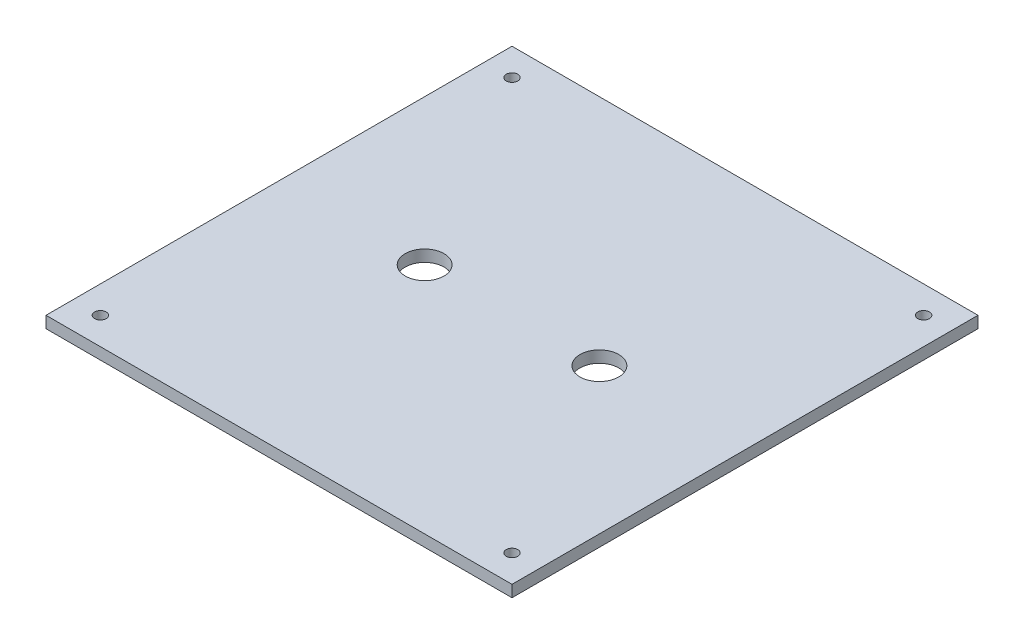
ISO-10303-21;
HEADER;
FILE_DESCRIPTION(('STEP AP214'),'2;1');
FILE_NAME('part.step','',(''),(''),'','','');
FILE_SCHEMA(('AUTOMOTIVE_DESIGN { 1 0 10303 214 1 1 1 1 }'));
ENDSEC;
DATA;
#1=APPLICATION_CONTEXT('core data for automotive mechanical design processes');
#2=APPLICATION_PROTOCOL_DEFINITION('international standard','automotive_design',2000,#1);
#3=PRODUCT_CONTEXT('',#1,'mechanical');
#4=PRODUCT('Part','Part','',(#3));
#5=PRODUCT_RELATED_PRODUCT_CATEGORY('part','',(#4));
#6=PRODUCT_DEFINITION_FORMATION('','',#4);
#7=PRODUCT_DEFINITION_CONTEXT('part definition',#1,'design');
#8=PRODUCT_DEFINITION('design','',#6,#7);
#9=PRODUCT_DEFINITION_SHAPE('','',#8);
#10=(LENGTH_UNIT() NAMED_UNIT(*) SI_UNIT(.MILLI.,.METRE.));
#11=(NAMED_UNIT(*) PLANE_ANGLE_UNIT() SI_UNIT($,.RADIAN.));
#12=(NAMED_UNIT(*) SI_UNIT($,.STERADIAN.) SOLID_ANGLE_UNIT());
#13=UNCERTAINTY_MEASURE_WITH_UNIT(LENGTH_MEASURE(1.E-05),#10,'distance_accuracy_value','');
#14=(GEOMETRIC_REPRESENTATION_CONTEXT(3) GLOBAL_UNCERTAINTY_ASSIGNED_CONTEXT((#13)) GLOBAL_UNIT_ASSIGNED_CONTEXT((#10,
#11,#12)) REPRESENTATION_CONTEXT('',''));
#15=CARTESIAN_POINT('',(0.,0.,0.));
#16=DIRECTION('',(0.,0.,1.));
#17=DIRECTION('',(1.,0.,0.));
#18=AXIS2_PLACEMENT_3D('',#15,#16,#17);
#19=CARTESIAN_POINT('',(60.,3.,60.));
#20=DIRECTION('',(-1.,0.,0.));
#21=DIRECTION('',(0.,0.,1.));
#22=AXIS2_PLACEMENT_3D('',#19,#20,#21);
#23=PLANE('',#22);
#24=DIRECTION('',(0.,0.,-1.));
#25=VECTOR('',#24,1.);
#26=CARTESIAN_POINT('',(60.,0.,60.));
#27=LINE('',#26,#25);
#28=CARTESIAN_POINT('',(60.,0.,60.));
#29=VERTEX_POINT('',#28);
#30=CARTESIAN_POINT('',(60.,0.,-60.));
#31=VERTEX_POINT('',#30);
#32=EDGE_CURVE('E96',#29,#31,#27,.T.);
#33=ORIENTED_EDGE('',*,*,#32,.T.);
#34=DIRECTION('',(0.,-1.,0.));
#35=VECTOR('',#34,1.);
#36=CARTESIAN_POINT('',(60.,3.,-60.));
#37=LINE('',#36,#35);
#38=CARTESIAN_POINT('',(60.,3.,-60.));
#39=VERTEX_POINT('',#38);
#40=EDGE_CURVE('E11',#39,#31,#37,.T.);
#41=ORIENTED_EDGE('',*,*,#40,.F.);
#42=DIRECTION('',(0.,0.,-1.));
#43=VECTOR('',#42,1.);
#44=CARTESIAN_POINT('',(60.,3.,60.));
#45=LINE('',#44,#43);
#46=CARTESIAN_POINT('',(60.,3.,60.));
#47=VERTEX_POINT('',#46);
#48=EDGE_CURVE('E84',#47,#39,#45,.T.);
#49=ORIENTED_EDGE('',*,*,#48,.F.);
#50=DIRECTION('',(0.,-1.,0.));
#51=VECTOR('',#50,1.);
#52=CARTESIAN_POINT('',(60.,3.,60.));
#53=LINE('',#52,#51);
#54=EDGE_CURVE('E92',#47,#29,#53,.T.);
#55=ORIENTED_EDGE('',*,*,#54,.T.);
#56=EDGE_LOOP('',(#33,#41,#49,#55));
#57=FACE_BOUND('',#56,.T.);
#58=ADVANCED_FACE('F33',(#57),#23,.F.);
#59=CARTESIAN_POINT('',(-60.,3.,-60.));
#60=DIRECTION('',(0.,0.,1.));
#61=DIRECTION('',(1.,0.,0.));
#62=AXIS2_PLACEMENT_3D('',#59,#60,#61);
#63=PLANE('',#62);
#64=DIRECTION('',(-1.,0.,0.));
#65=VECTOR('',#64,1.);
#66=CARTESIAN_POINT('',(-60.,0.,-60.));
#67=LINE('',#66,#65);
#68=CARTESIAN_POINT('',(-60.,0.,-60.));
#69=VERTEX_POINT('',#68);
#70=EDGE_CURVE('E88',#31,#69,#67,.T.);
#71=ORIENTED_EDGE('',*,*,#70,.T.);
#72=DIRECTION('',(0.,-1.,0.));
#73=VECTOR('',#72,1.);
#74=CARTESIAN_POINT('',(-60.,3.,-60.));
#75=LINE('',#74,#73);
#76=CARTESIAN_POINT('',(-60.,3.,-60.));
#77=VERTEX_POINT('',#76);
#78=EDGE_CURVE('E41',#77,#69,#75,.T.);
#79=ORIENTED_EDGE('',*,*,#78,.F.);
#80=DIRECTION('',(-1.,0.,0.));
#81=VECTOR('',#80,1.);
#82=CARTESIAN_POINT('',(-60.,3.,-60.));
#83=LINE('',#82,#81);
#84=EDGE_CURVE('E79',#39,#77,#83,.T.);
#85=ORIENTED_EDGE('',*,*,#84,.F.);
#86=ORIENTED_EDGE('',*,*,#40,.T.);
#87=EDGE_LOOP('',(#71,#79,#85,#86));
#88=FACE_BOUND('',#87,.T.);
#89=ADVANCED_FACE('F87',(#88),#63,.F.);
#90=CARTESIAN_POINT('',(-60.,3.,60.));
#91=DIRECTION('',(1.,0.,0.));
#92=DIRECTION('',(0.,0.,-1.));
#93=AXIS2_PLACEMENT_3D('',#90,#91,#92);
#94=PLANE('',#93);
#95=DIRECTION('',(0.,0.,1.));
#96=VECTOR('',#95,1.);
#97=CARTESIAN_POINT('',(-60.,0.,60.));
#98=LINE('',#97,#96);
#99=CARTESIAN_POINT('',(-60.,0.,60.));
#100=VERTEX_POINT('',#99);
#101=EDGE_CURVE('E66',#69,#100,#98,.T.);
#102=ORIENTED_EDGE('',*,*,#101,.T.);
#103=DIRECTION('',(0.,-1.,0.));
#104=VECTOR('',#103,1.);
#105=CARTESIAN_POINT('',(-60.,3.,60.));
#106=LINE('',#105,#104);
#107=CARTESIAN_POINT('',(-60.,3.,60.));
#108=VERTEX_POINT('',#107);
#109=EDGE_CURVE('E89',#108,#100,#106,.T.);
#110=ORIENTED_EDGE('',*,*,#109,.F.);
#111=DIRECTION('',(0.,0.,1.));
#112=VECTOR('',#111,1.);
#113=CARTESIAN_POINT('',(-60.,3.,60.));
#114=LINE('',#113,#112);
#115=EDGE_CURVE('E82',#77,#108,#114,.T.);
#116=ORIENTED_EDGE('',*,*,#115,.F.);
#117=ORIENTED_EDGE('',*,*,#78,.T.);
#118=EDGE_LOOP('',(#102,#110,#116,#117));
#119=FACE_BOUND('',#118,.T.);
#120=ADVANCED_FACE('F90',(#119),#94,.F.);
#121=CARTESIAN_POINT('',(-60.,3.,60.));
#122=DIRECTION('',(0.,0.,-1.));
#123=DIRECTION('',(-1.,0.,0.));
#124=AXIS2_PLACEMENT_3D('',#121,#122,#123);
#125=PLANE('',#124);
#126=DIRECTION('',(1.,0.,0.));
#127=VECTOR('',#126,1.);
#128=CARTESIAN_POINT('',(-60.,0.,60.));
#129=LINE('',#128,#127);
#130=EDGE_CURVE('E72',#100,#29,#129,.T.);
#131=ORIENTED_EDGE('',*,*,#130,.T.);
#132=ORIENTED_EDGE('',*,*,#54,.F.);
#133=DIRECTION('',(1.,0.,0.));
#134=VECTOR('',#133,1.);
#135=CARTESIAN_POINT('',(-60.,3.,60.));
#136=LINE('',#135,#134);
#137=EDGE_CURVE('E49',#108,#47,#136,.T.);
#138=ORIENTED_EDGE('',*,*,#137,.F.);
#139=ORIENTED_EDGE('',*,*,#109,.T.);
#140=EDGE_LOOP('',(#131,#132,#138,#139));
#141=FACE_BOUND('',#140,.T.);
#142=ADVANCED_FACE('F104',(#141),#125,.F.);
#143=CARTESIAN_POINT('',(0.,3.,0.));
#144=DIRECTION('',(0.,-1.,0.));
#145=DIRECTION('',(0.,0.,-1.));
#146=AXIS2_PLACEMENT_3D('',#143,#144,#145);
#147=PLANE('',#146);
#148=CARTESIAN_POINT('',(52.9999999999986,3.,-52.9999999999986));
#149=DIRECTION('',(0.,-1.,0.));
#150=DIRECTION('',(0.,0.,-1.));
#151=AXIS2_PLACEMENT_3D('',#148,#149,#150);
#152=CIRCLE('',#151,1.5);
#153=CARTESIAN_POINT('',(52.9999999999986,3.,-54.4999999999986));
#154=VERTEX_POINT('',#153);
#155=EDGE_CURVE('E127',#154,#154,#152,.T.);
#156=ORIENTED_EDGE('',*,*,#155,.T.);
#157=EDGE_LOOP('',(#156));
#158=FACE_BOUND('',#157,.T.);
#159=CARTESIAN_POINT('',(-52.9999999999702,3.,53.0000000000271));
#160=DIRECTION('',(0.,-1.,0.));
#161=DIRECTION('',(0.,0.,-1.));
#162=AXIS2_PLACEMENT_3D('',#159,#160,#161);
#163=CIRCLE('',#162,1.5);
#164=CARTESIAN_POINT('',(-52.9999999999702,3.,51.5000000000271));
#165=VERTEX_POINT('',#164);
#166=EDGE_CURVE('E128',#165,#165,#163,.T.);
#167=ORIENTED_EDGE('',*,*,#166,.T.);
#168=EDGE_LOOP('',(#167));
#169=FACE_BOUND('',#168,.T.);
#170=CARTESIAN_POINT('',(52.9999999999986,3.,52.9999999999986));
#171=DIRECTION('',(0.,-1.,0.));
#172=DIRECTION('',(0.,0.,-1.));
#173=AXIS2_PLACEMENT_3D('',#170,#171,#172);
#174=CIRCLE('',#173,1.5);
#175=CARTESIAN_POINT('',(52.9999999999986,3.,51.4999999999986));
#176=VERTEX_POINT('',#175);
#177=EDGE_CURVE('E135',#176,#176,#174,.T.);
#178=ORIENTED_EDGE('',*,*,#177,.T.);
#179=EDGE_LOOP('',(#178));
#180=FACE_BOUND('',#179,.T.);
#181=CARTESIAN_POINT('',(-52.9999999999986,3.,-52.9999999999986));
#182=DIRECTION('',(0.,-1.,0.));
#183=DIRECTION('',(0.,0.,-1.));
#184=AXIS2_PLACEMENT_3D('',#181,#182,#183);
#185=CIRCLE('',#184,1.5);
#186=CARTESIAN_POINT('',(-52.9999999999986,3.,-54.4999999999986));
#187=VERTEX_POINT('',#186);
#188=EDGE_CURVE('E117',#187,#187,#185,.T.);
#189=ORIENTED_EDGE('',*,*,#188,.T.);
#190=EDGE_LOOP('',(#189));
#191=FACE_BOUND('',#190,.T.);
#192=CARTESIAN_POINT('',(-22.500000000004,3.,0.));
#193=DIRECTION('',(0.,-1.,0.));
#194=DIRECTION('',(0.,0.,-1.));
#195=AXIS2_PLACEMENT_3D('',#192,#193,#194);
#196=CIRCLE('',#195,5.);
#197=CARTESIAN_POINT('',(-22.500000000004,3.,-5.));
#198=VERTEX_POINT('',#197);
#199=EDGE_CURVE('E99',#198,#198,#196,.T.);
#200=ORIENTED_EDGE('',*,*,#199,.T.);
#201=EDGE_LOOP('',(#200));
#202=FACE_BOUND('',#201,.T.);
#203=CARTESIAN_POINT('',(22.500000000004,3.,0.));
#204=DIRECTION('',(0.,-1.,0.));
#205=DIRECTION('',(0.,0.,-1.));
#206=AXIS2_PLACEMENT_3D('',#203,#204,#205);
#207=CIRCLE('',#206,5.);
#208=CARTESIAN_POINT('',(22.500000000004,3.,-5.));
#209=VERTEX_POINT('',#208);
#210=EDGE_CURVE('E110',#209,#209,#207,.T.);
#211=ORIENTED_EDGE('',*,*,#210,.T.);
#212=EDGE_LOOP('',(#211));
#213=FACE_BOUND('',#212,.T.);
#214=ORIENTED_EDGE('',*,*,#48,.T.);
#215=ORIENTED_EDGE('',*,*,#84,.T.);
#216=ORIENTED_EDGE('',*,*,#115,.T.);
#217=ORIENTED_EDGE('',*,*,#137,.T.);
#218=EDGE_LOOP('',(#214,#215,#216,#217));
#219=FACE_BOUND('',#218,.T.);
#220=ADVANCED_FACE('F80',(#158,#169,#180,#191,#202,#213,#219),#147,.F.);
#221=CARTESIAN_POINT('',(0.,0.,0.));
#222=DIRECTION('',(0.,-1.,0.));
#223=DIRECTION('',(0.,0.,-1.));
#224=AXIS2_PLACEMENT_3D('',#221,#222,#223);
#225=PLANE('',#224);
#226=CARTESIAN_POINT('',(52.9999999999986,0.,-52.9999999999986));
#227=DIRECTION('',(0.,1.,0.));
#228=DIRECTION('',(0.,0.,1.));
#229=AXIS2_PLACEMENT_3D('',#226,#227,#228);
#230=CIRCLE('',#229,1.5);
#231=CARTESIAN_POINT('',(52.9999999999986,0.,-51.4999999999986));
#232=VERTEX_POINT('',#231);
#233=EDGE_CURVE('E131',#232,#232,#230,.T.);
#234=ORIENTED_EDGE('',*,*,#233,.T.);
#235=EDGE_LOOP('',(#234));
#236=FACE_BOUND('',#235,.T.);
#237=CARTESIAN_POINT('',(-52.9999999999702,0.,53.0000000000271));
#238=DIRECTION('',(0.,1.,0.));
#239=DIRECTION('',(0.,0.,1.));
#240=AXIS2_PLACEMENT_3D('',#237,#238,#239);
#241=CIRCLE('',#240,1.5);
#242=CARTESIAN_POINT('',(-52.9999999999702,0.,54.5000000000271));
#243=VERTEX_POINT('',#242);
#244=EDGE_CURVE('E132',#243,#243,#241,.T.);
#245=ORIENTED_EDGE('',*,*,#244,.T.);
#246=EDGE_LOOP('',(#245));
#247=FACE_BOUND('',#246,.T.);
#248=CARTESIAN_POINT('',(52.9999999999986,0.,52.9999999999986));
#249=DIRECTION('',(0.,1.,0.));
#250=DIRECTION('',(0.,0.,1.));
#251=AXIS2_PLACEMENT_3D('',#248,#249,#250);
#252=CIRCLE('',#251,1.5);
#253=CARTESIAN_POINT('',(52.9999999999986,0.,54.4999999999986));
#254=VERTEX_POINT('',#253);
#255=EDGE_CURVE('E142',#254,#254,#252,.T.);
#256=ORIENTED_EDGE('',*,*,#255,.T.);
#257=EDGE_LOOP('',(#256));
#258=FACE_BOUND('',#257,.T.);
#259=CARTESIAN_POINT('',(-52.9999999999986,0.,-52.9999999999986));
#260=DIRECTION('',(0.,1.,0.));
#261=DIRECTION('',(0.,0.,1.));
#262=AXIS2_PLACEMENT_3D('',#259,#260,#261);
#263=CIRCLE('',#262,1.5);
#264=CARTESIAN_POINT('',(-52.9999999999986,0.,-51.4999999999986));
#265=VERTEX_POINT('',#264);
#266=EDGE_CURVE('E124',#265,#265,#263,.T.);
#267=ORIENTED_EDGE('',*,*,#266,.T.);
#268=EDGE_LOOP('',(#267));
#269=FACE_BOUND('',#268,.T.);
#270=CARTESIAN_POINT('',(-22.500000000004,0.,0.));
#271=DIRECTION('',(0.,1.,0.));
#272=DIRECTION('',(0.,0.,1.));
#273=AXIS2_PLACEMENT_3D('',#270,#271,#272);
#274=CIRCLE('',#273,5.);
#275=CARTESIAN_POINT('',(-22.500000000004,0.,5.));
#276=VERTEX_POINT('',#275);
#277=EDGE_CURVE('E113',#276,#276,#274,.T.);
#278=ORIENTED_EDGE('',*,*,#277,.T.);
#279=EDGE_LOOP('',(#278));
#280=FACE_BOUND('',#279,.T.);
#281=CARTESIAN_POINT('',(22.500000000004,0.,0.));
#282=DIRECTION('',(0.,1.,0.));
#283=DIRECTION('',(0.,0.,1.));
#284=AXIS2_PLACEMENT_3D('',#281,#282,#283);
#285=CIRCLE('',#284,5.);
#286=CARTESIAN_POINT('',(22.500000000004,0.,5.));
#287=VERTEX_POINT('',#286);
#288=EDGE_CURVE('E114',#287,#287,#285,.T.);
#289=ORIENTED_EDGE('',*,*,#288,.T.);
#290=EDGE_LOOP('',(#289));
#291=FACE_BOUND('',#290,.T.);
#292=ORIENTED_EDGE('',*,*,#32,.F.);
#293=ORIENTED_EDGE('',*,*,#130,.F.);
#294=ORIENTED_EDGE('',*,*,#101,.F.);
#295=ORIENTED_EDGE('',*,*,#70,.F.);
#296=EDGE_LOOP('',(#292,#293,#294,#295));
#297=FACE_BOUND('',#296,.T.);
#298=ADVANCED_FACE('F107',(#236,#247,#258,#269,#280,#291,#297),#225,.T.);
#299=CARTESIAN_POINT('',(22.500000000004,17.142135623731,0.));
#300=DIRECTION('',(0.,-1.,0.));
#301=DIRECTION('',(0.,0.,-1.));
#302=AXIS2_PLACEMENT_3D('',#299,#300,#301);
#303=CYLINDRICAL_SURFACE('',#302,5.);
#304=ORIENTED_EDGE('',*,*,#210,.F.);
#305=EDGE_LOOP('',(#304));
#306=FACE_BOUND('',#305,.T.);
#307=ORIENTED_EDGE('',*,*,#288,.F.);
#308=EDGE_LOOP('',(#307));
#309=FACE_BOUND('',#308,.T.);
#310=ADVANCED_FACE('F179',(#306,#309),#303,.F.);
#311=CARTESIAN_POINT('',(-22.500000000004,17.142135623731,0.));
#312=DIRECTION('',(0.,-1.,0.));
#313=DIRECTION('',(0.,0.,-1.));
#314=AXIS2_PLACEMENT_3D('',#311,#312,#313);
#315=CYLINDRICAL_SURFACE('',#314,5.);
#316=ORIENTED_EDGE('',*,*,#199,.F.);
#317=EDGE_LOOP('',(#316));
#318=FACE_BOUND('',#317,.T.);
#319=ORIENTED_EDGE('',*,*,#277,.F.);
#320=EDGE_LOOP('',(#319));
#321=FACE_BOUND('',#320,.T.);
#322=ADVANCED_FACE('F161',(#318,#321),#315,.F.);
#323=CARTESIAN_POINT('',(-52.9999999999986,7.24264068711929,-52.9999999999986));
#324=DIRECTION('',(0.,-1.,0.));
#325=DIRECTION('',(0.,0.,-1.));
#326=AXIS2_PLACEMENT_3D('',#323,#324,#325);
#327=CYLINDRICAL_SURFACE('',#326,1.5);
#328=ORIENTED_EDGE('',*,*,#188,.F.);
#329=EDGE_LOOP('',(#328));
#330=FACE_BOUND('',#329,.T.);
#331=ORIENTED_EDGE('',*,*,#266,.F.);
#332=EDGE_LOOP('',(#331));
#333=FACE_BOUND('',#332,.T.);
#334=ADVANCED_FACE('F151',(#330,#333),#327,.F.);
#335=CARTESIAN_POINT('',(52.9999999999986,7.24264068711929,52.9999999999986));
#336=DIRECTION('',(0.,-1.,0.));
#337=DIRECTION('',(0.,0.,-1.));
#338=AXIS2_PLACEMENT_3D('',#335,#336,#337);
#339=CYLINDRICAL_SURFACE('',#338,1.5);
#340=ORIENTED_EDGE('',*,*,#177,.F.);
#341=EDGE_LOOP('',(#340));
#342=FACE_BOUND('',#341,.T.);
#343=ORIENTED_EDGE('',*,*,#255,.F.);
#344=EDGE_LOOP('',(#343));
#345=FACE_BOUND('',#344,.T.);
#346=ADVANCED_FACE('F148',(#342,#345),#339,.F.);
#347=CARTESIAN_POINT('',(-52.9999999999702,7.24264068711929,53.0000000000271));
#348=DIRECTION('',(0.,-1.,0.));
#349=DIRECTION('',(0.,0.,-1.));
#350=AXIS2_PLACEMENT_3D('',#347,#348,#349);
#351=CYLINDRICAL_SURFACE('',#350,1.5);
#352=ORIENTED_EDGE('',*,*,#166,.F.);
#353=EDGE_LOOP('',(#352));
#354=FACE_BOUND('',#353,.T.);
#355=ORIENTED_EDGE('',*,*,#244,.F.);
#356=EDGE_LOOP('',(#355));
#357=FACE_BOUND('',#356,.T.);
#358=ADVANCED_FACE('F150',(#354,#357),#351,.F.);
#359=CARTESIAN_POINT('',(52.9999999999986,7.24264068711929,-52.9999999999986));
#360=DIRECTION('',(0.,-1.,0.));
#361=DIRECTION('',(0.,0.,-1.));
#362=AXIS2_PLACEMENT_3D('',#359,#360,#361);
#363=CYLINDRICAL_SURFACE('',#362,1.5);
#364=ORIENTED_EDGE('',*,*,#155,.F.);
#365=EDGE_LOOP('',(#364));
#366=FACE_BOUND('',#365,.T.);
#367=ORIENTED_EDGE('',*,*,#233,.F.);
#368=EDGE_LOOP('',(#367));
#369=FACE_BOUND('',#368,.T.);
#370=ADVANCED_FACE('F158',(#366,#369),#363,.F.);
#371=CLOSED_SHELL('',(#58,#89,#120,#142,#220,#298,#310,#322,#334,#346,#358,#370));
#372=MANIFOLD_SOLID_BREP('B2',#371);
#373=ADVANCED_BREP_SHAPE_REPRESENTATION('',(#18,#372),#14);
#374=SHAPE_DEFINITION_REPRESENTATION(#9,#373);
ENDSEC;
END-ISO-10303-21;
